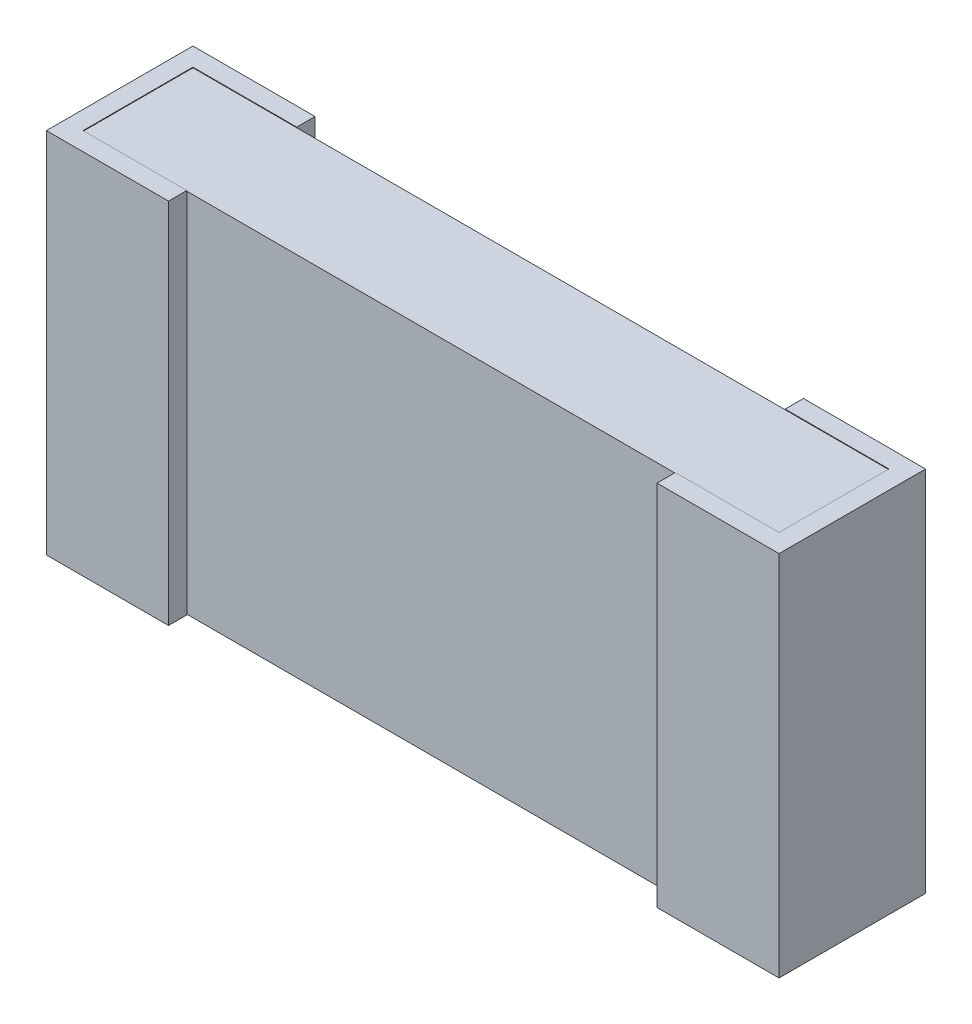
ISO-10303-21;
HEADER;
FILE_DESCRIPTION(('STEP AP214'),'2;1');
FILE_NAME('part.step','',(''),(''),'','','');
FILE_SCHEMA(('AUTOMOTIVE_DESIGN { 1 0 10303 214 1 1 1 1 }'));
ENDSEC;
DATA;
#1=APPLICATION_CONTEXT('core data for automotive mechanical design processes');
#2=APPLICATION_PROTOCOL_DEFINITION('international standard','automotive_design',2000,#1);
#3=PRODUCT_CONTEXT('',#1,'mechanical');
#4=PRODUCT('Part','Part','',(#3));
#5=PRODUCT_RELATED_PRODUCT_CATEGORY('part','',(#4));
#6=PRODUCT_DEFINITION_FORMATION('','',#4);
#7=PRODUCT_DEFINITION_CONTEXT('part definition',#1,'design');
#8=PRODUCT_DEFINITION('design','',#6,#7);
#9=PRODUCT_DEFINITION_SHAPE('','',#8);
#10=(LENGTH_UNIT() NAMED_UNIT(*) SI_UNIT(.MILLI.,.METRE.));
#11=(NAMED_UNIT(*) PLANE_ANGLE_UNIT() SI_UNIT($,.RADIAN.));
#12=(NAMED_UNIT(*) SI_UNIT($,.STERADIAN.) SOLID_ANGLE_UNIT());
#13=UNCERTAINTY_MEASURE_WITH_UNIT(LENGTH_MEASURE(1.E-05),#10,'distance_accuracy_value','');
#14=(GEOMETRIC_REPRESENTATION_CONTEXT(3) GLOBAL_UNCERTAINTY_ASSIGNED_CONTEXT((#13)) GLOBAL_UNIT_ASSIGNED_CONTEXT((#10,
#11,#12)) REPRESENTATION_CONTEXT('',''));
#15=CARTESIAN_POINT('',(0.,0.,0.));
#16=DIRECTION('',(0.,0.,1.));
#17=DIRECTION('',(1.,0.,0.));
#18=AXIS2_PLACEMENT_3D('',#15,#16,#17);
#19=CARTESIAN_POINT('',(0.0762,0.762,0.533400000000122));
#20=DIRECTION('',(0.,0.,-1.));
#21=DIRECTION('',(-1.,0.,0.));
#22=AXIS2_PLACEMENT_3D('',#19,#20,#21);
#23=PLANE('',#22);
#24=DIRECTION('',(0.,1.,0.));
#25=VECTOR('',#24,1.);
#26=CARTESIAN_POINT('',(2.54000000000002,-0.76454,0.533400000000122));
#27=LINE('',#26,#25);
#28=CARTESIAN_POINT('',(2.54000000000001,-0.762,0.533400000000122));
#29=VERTEX_POINT('',#28);
#30=CARTESIAN_POINT('',(2.54000000000001,0.762,0.533400000000122));
#31=VERTEX_POINT('',#30);
#32=EDGE_CURVE('E55',#29,#31,#27,.T.);
#33=ORIENTED_EDGE('',*,*,#32,.T.);
#34=DIRECTION('',(1.,0.,0.));
#35=VECTOR('',#34,1.);
#36=CARTESIAN_POINT('',(0.0762,0.762,0.533400000000122));
#37=LINE('',#36,#35);
#38=CARTESIAN_POINT('',(0.507999999999976,0.762,0.533400000000122));
#39=VERTEX_POINT('',#38);
#40=EDGE_CURVE('E40',#39,#31,#37,.T.);
#41=ORIENTED_EDGE('',*,*,#40,.F.);
#42=DIRECTION('',(0.,1.,0.));
#43=VECTOR('',#42,1.);
#44=CARTESIAN_POINT('',(0.507999999999976,-0.76454,0.533400000000122));
#45=LINE('',#44,#43);
#46=CARTESIAN_POINT('',(0.507999999999976,-0.762,0.533400000000122));
#47=VERTEX_POINT('',#46);
#48=EDGE_CURVE('E351',#47,#39,#45,.T.);
#49=ORIENTED_EDGE('',*,*,#48,.F.);
#50=DIRECTION('',(1.,0.,0.));
#51=VECTOR('',#50,1.);
#52=CARTESIAN_POINT('',(0.0762,-0.762,0.533400000000122));
#53=LINE('',#52,#51);
#54=EDGE_CURVE('E368',#47,#29,#53,.T.);
#55=ORIENTED_EDGE('',*,*,#54,.T.);
#56=EDGE_LOOP('',(#33,#41,#49,#55));
#57=FACE_BOUND('',#56,.T.);
#58=ADVANCED_FACE('F32',(#57),#23,.F.);
#59=CARTESIAN_POINT('',(2.9718,0.762,0.0762000000001228));
#60=DIRECTION('',(0.,0.,1.));
#61=DIRECTION('',(1.,0.,0.));
#62=AXIS2_PLACEMENT_3D('',#59,#60,#61);
#63=PLANE('',#62);
#64=DIRECTION('',(0.,1.,0.));
#65=VECTOR('',#64,1.);
#66=CARTESIAN_POINT('',(2.54,-0.76454,0.0762000000001224));
#67=LINE('',#66,#65);
#68=CARTESIAN_POINT('',(2.54,-0.762,0.0762000000001224));
#69=VERTEX_POINT('',#68);
#70=CARTESIAN_POINT('',(2.54000000000001,0.762,0.0762000000001224));
#71=VERTEX_POINT('',#70);
#72=EDGE_CURVE('E275',#69,#71,#67,.T.);
#73=ORIENTED_EDGE('',*,*,#72,.F.);
#74=DIRECTION('',(-1.,0.,0.));
#75=VECTOR('',#74,1.);
#76=CARTESIAN_POINT('',(2.9718,-0.762,0.0762000000001228));
#77=LINE('',#76,#75);
#78=CARTESIAN_POINT('',(0.508,-0.762,0.0762000000001224));
#79=VERTEX_POINT('',#78);
#80=EDGE_CURVE('E362',#69,#79,#77,.T.);
#81=ORIENTED_EDGE('',*,*,#80,.T.);
#82=DIRECTION('',(0.,1.,0.));
#83=VECTOR('',#82,1.);
#84=CARTESIAN_POINT('',(0.508,-0.76454,0.0762000000001224));
#85=LINE('',#84,#83);
#86=CARTESIAN_POINT('',(0.508,0.762,0.0762000000001224));
#87=VERTEX_POINT('',#86);
#88=EDGE_CURVE('E338',#79,#87,#85,.T.);
#89=ORIENTED_EDGE('',*,*,#88,.T.);
#90=DIRECTION('',(-1.,0.,0.));
#91=VECTOR('',#90,1.);
#92=CARTESIAN_POINT('',(2.9718,0.762,0.0762000000001228));
#93=LINE('',#92,#91);
#94=EDGE_CURVE('E47',#71,#87,#93,.T.);
#95=ORIENTED_EDGE('',*,*,#94,.F.);
#96=EDGE_LOOP('',(#73,#81,#89,#95));
#97=FACE_BOUND('',#96,.T.);
#98=ADVANCED_FACE('F34',(#97),#63,.F.);
#99=CARTESIAN_POINT('',(0.0762000000000002,0.762,0.0762000000001225));
#100=DIRECTION('',(0.,1.,0.));
#101=DIRECTION('',(0.,0.,1.));
#102=AXIS2_PLACEMENT_3D('',#99,#100,#101);
#103=PLANE('',#102);
#104=DIRECTION('',(0.,0.,-1.));
#105=VECTOR('',#104,1.);
#106=CARTESIAN_POINT('',(0.0762,0.762,0.533400000000122));
#107=LINE('',#106,#105);
#108=CARTESIAN_POINT('',(0.0762,0.762,0.533400000000122));
#109=VERTEX_POINT('',#108);
#110=CARTESIAN_POINT('',(0.0762000000000002,0.762,0.0762000000001224));
#111=VERTEX_POINT('',#110);
#112=EDGE_CURVE('E367',#109,#111,#107,.T.);
#113=ORIENTED_EDGE('',*,*,#112,.F.);
#114=EDGE_CURVE('E11',#109,#39,#37,.T.);
#115=ORIENTED_EDGE('',*,*,#114,.T.);
#116=ORIENTED_EDGE('',*,*,#40,.T.);
#117=DIRECTION('',(-1.,0.,0.));
#118=VECTOR('',#117,1.);
#119=CARTESIAN_POINT('',(0.0762000000000002,0.762,0.533400000000122));
#120=LINE('',#119,#118);
#121=CARTESIAN_POINT('',(2.9718,0.762,0.533400000000122));
#122=VERTEX_POINT('',#121);
#123=EDGE_CURVE('E279',#122,#31,#120,.T.);
#124=ORIENTED_EDGE('',*,*,#123,.F.);
#125=DIRECTION('',(0.,0.,1.));
#126=VECTOR('',#125,1.);
#127=CARTESIAN_POINT('',(2.9718,0.762,0.0762000000001228));
#128=LINE('',#127,#126);
#129=CARTESIAN_POINT('',(2.9718,0.762,0.0762000000001228));
#130=VERTEX_POINT('',#129);
#131=EDGE_CURVE('E204',#130,#122,#128,.T.);
#132=ORIENTED_EDGE('',*,*,#131,.F.);
#133=EDGE_CURVE('E370',#130,#71,#93,.T.);
#134=ORIENTED_EDGE('',*,*,#133,.T.);
#135=ORIENTED_EDGE('',*,*,#94,.T.);
#136=DIRECTION('',(-1.,0.,0.));
#137=VECTOR('',#136,1.);
#138=CARTESIAN_POINT('',(0.0762000000000002,0.762,0.0762000000001224));
#139=LINE('',#138,#137);
#140=EDGE_CURVE('E350',#87,#111,#139,.T.);
#141=ORIENTED_EDGE('',*,*,#140,.T.);
#142=EDGE_LOOP('',(#113,#115,#116,#124,#132,#134,#135,#141));
#143=FACE_BOUND('',#142,.T.);
#144=ADVANCED_FACE('F373',(#143),#103,.T.);
#145=CARTESIAN_POINT('',(0.0762000000000002,-0.762,0.0762000000001225));
#146=DIRECTION('',(0.,1.,0.));
#147=DIRECTION('',(0.,0.,1.));
#148=AXIS2_PLACEMENT_3D('',#145,#146,#147);
#149=PLANE('',#148);
#150=DIRECTION('',(0.,0.,-1.));
#151=VECTOR('',#150,1.);
#152=CARTESIAN_POINT('',(0.0762,-0.762,0.533400000000122));
#153=LINE('',#152,#151);
#154=CARTESIAN_POINT('',(0.0762,-0.762,0.533400000000122));
#155=VERTEX_POINT('',#154);
#156=CARTESIAN_POINT('',(0.0762000000000002,-0.762,0.0762000000001225));
#157=VERTEX_POINT('',#156);
#158=EDGE_CURVE('E354',#155,#157,#153,.T.);
#159=ORIENTED_EDGE('',*,*,#158,.T.);
#160=EDGE_CURVE('E357',#79,#157,#77,.T.);
#161=ORIENTED_EDGE('',*,*,#160,.F.);
#162=ORIENTED_EDGE('',*,*,#80,.F.);
#163=CARTESIAN_POINT('',(2.9718,-0.762,0.0762000000001228));
#164=VERTEX_POINT('',#163);
#165=EDGE_CURVE('E358',#164,#69,#77,.T.);
#166=ORIENTED_EDGE('',*,*,#165,.F.);
#167=DIRECTION('',(0.,0.,1.));
#168=VECTOR('',#167,1.);
#169=CARTESIAN_POINT('',(2.9718,-0.762,0.0762000000001228));
#170=LINE('',#169,#168);
#171=CARTESIAN_POINT('',(2.9718,-0.762,0.533400000000122));
#172=VERTEX_POINT('',#171);
#173=EDGE_CURVE('E361',#164,#172,#170,.T.);
#174=ORIENTED_EDGE('',*,*,#173,.T.);
#175=EDGE_CURVE('E364',#29,#172,#53,.T.);
#176=ORIENTED_EDGE('',*,*,#175,.F.);
#177=ORIENTED_EDGE('',*,*,#54,.F.);
#178=EDGE_CURVE('E365',#155,#47,#53,.T.);
#179=ORIENTED_EDGE('',*,*,#178,.F.);
#180=EDGE_LOOP('',(#159,#161,#162,#166,#174,#176,#177,#179));
#181=FACE_BOUND('',#180,.T.);
#182=ADVANCED_FACE('F420',(#181),#149,.F.);
#183=CARTESIAN_POINT('',(0.0762,-0.76454,0.533400000000122));
#184=DIRECTION('',(0.,0.,1.));
#185=DIRECTION('',(1.,0.,0.));
#186=AXIS2_PLACEMENT_3D('',#183,#184,#185);
#187=PLANE('',#186);
#188=DIRECTION('',(0.,1.,0.));
#189=VECTOR('',#188,1.);
#190=CARTESIAN_POINT('',(0.0762,-0.76454,0.533400000000122));
#191=LINE('',#190,#189);
#192=CARTESIAN_POINT('',(0.0762,-0.76454,0.533400000000122));
#193=VERTEX_POINT('',#192);
#194=EDGE_CURVE('E327',#193,#155,#191,.T.);
#195=ORIENTED_EDGE('',*,*,#194,.T.);
#196=ORIENTED_EDGE('',*,*,#178,.T.);
#197=CARTESIAN_POINT('',(0.507999999999976,-0.76454,0.533400000000122));
#198=VERTEX_POINT('',#197);
#199=EDGE_CURVE('E347',#198,#47,#45,.T.);
#200=ORIENTED_EDGE('',*,*,#199,.F.);
#201=DIRECTION('',(1.,0.,0.));
#202=VECTOR('',#201,1.);
#203=CARTESIAN_POINT('',(0.0762,-0.76454,0.533400000000122));
#204=LINE('',#203,#202);
#205=EDGE_CURVE('E305',#193,#198,#204,.T.);
#206=ORIENTED_EDGE('',*,*,#205,.F.);
#207=EDGE_LOOP('',(#195,#196,#200,#206));
#208=FACE_BOUND('',#207,.T.);
#209=ADVANCED_FACE('F427',(#208),#187,.F.);
#210=CARTESIAN_POINT('',(0.508,-0.76454,0.0762000000001224));
#211=DIRECTION('',(0.,0.,-1.));
#212=DIRECTION('',(-1.,0.,0.));
#213=AXIS2_PLACEMENT_3D('',#210,#211,#212);
#214=PLANE('',#213);
#215=CARTESIAN_POINT('',(0.508,-0.76454,0.0762000000001224));
#216=VERTEX_POINT('',#215);
#217=EDGE_CURVE('E334',#216,#79,#85,.T.);
#218=ORIENTED_EDGE('',*,*,#217,.T.);
#219=ORIENTED_EDGE('',*,*,#160,.T.);
#220=DIRECTION('',(0.,1.,0.));
#221=VECTOR('',#220,1.);
#222=CARTESIAN_POINT('',(0.0762000000000002,-0.76454,0.0762000000001224));
#223=LINE('',#222,#221);
#224=CARTESIAN_POINT('',(0.0762000000000002,-0.76454,0.0762000000001224));
#225=VERTEX_POINT('',#224);
#226=EDGE_CURVE('E331',#225,#157,#223,.T.);
#227=ORIENTED_EDGE('',*,*,#226,.F.);
#228=DIRECTION('',(-1.,0.,0.));
#229=VECTOR('',#228,1.);
#230=CARTESIAN_POINT('',(0.508,-0.76454,0.0762000000001224));
#231=LINE('',#230,#229);
#232=EDGE_CURVE('E322',#216,#225,#231,.T.);
#233=ORIENTED_EDGE('',*,*,#232,.F.);
#234=EDGE_LOOP('',(#218,#219,#227,#233));
#235=FACE_BOUND('',#234,.T.);
#236=ADVANCED_FACE('F416',(#235),#214,.F.);
#237=CARTESIAN_POINT('',(0.0762000000000002,-0.76454,0.0762000000001224));
#238=DIRECTION('',(-1.,0.,0.));
#239=DIRECTION('',(0.,0.,1.));
#240=AXIS2_PLACEMENT_3D('',#237,#238,#239);
#241=PLANE('',#240);
#242=ORIENTED_EDGE('',*,*,#226,.T.);
#243=ORIENTED_EDGE('',*,*,#158,.F.);
#244=ORIENTED_EDGE('',*,*,#194,.F.);
#245=DIRECTION('',(0.,0.,1.));
#246=VECTOR('',#245,1.);
#247=CARTESIAN_POINT('',(0.0762000000000002,-0.76454,0.0762000000001224));
#248=LINE('',#247,#246);
#249=EDGE_CURVE('E324',#225,#193,#248,.T.);
#250=ORIENTED_EDGE('',*,*,#249,.F.);
#251=EDGE_LOOP('',(#242,#243,#244,#250));
#252=FACE_BOUND('',#251,.T.);
#253=ADVANCED_FACE('F424',(#252),#241,.F.);
#254=ORIENTED_EDGE('',*,*,#114,.F.);
#255=CARTESIAN_POINT('',(0.0762,0.76454,0.533400000000122));
#256=VERTEX_POINT('',#255);
#257=EDGE_CURVE('E326',#109,#256,#191,.T.);
#258=ORIENTED_EDGE('',*,*,#257,.T.);
#259=DIRECTION('',(1.,0.,0.));
#260=VECTOR('',#259,1.);
#261=CARTESIAN_POINT('',(0.0762,0.76454,0.533400000000122));
#262=LINE('',#261,#260);
#263=CARTESIAN_POINT('',(0.507999999999976,0.76454,0.533400000000122));
#264=VERTEX_POINT('',#263);
#265=EDGE_CURVE('E281',#256,#264,#262,.T.);
#266=ORIENTED_EDGE('',*,*,#265,.T.);
#267=EDGE_CURVE('E346',#39,#264,#45,.T.);
#268=ORIENTED_EDGE('',*,*,#267,.F.);
#269=EDGE_LOOP('',(#254,#258,#266,#268));
#270=FACE_BOUND('',#269,.T.);
#271=ADVANCED_FACE('F448',(#270),#187,.F.);
#272=CARTESIAN_POINT('',(0.508,-0.76454,0.609599999999878));
#273=DIRECTION('',(1.,0.,-3.08755736784921E-13));
#274=DIRECTION('',(-3.08755736784921E-13,0.,-1.));
#275=AXIS2_PLACEMENT_3D('',#272,#273,#274);
#276=PLANE('',#275);
#277=DIRECTION('',(-3.08755736784921E-13,0.,-1.));
#278=VECTOR('',#277,1.);
#279=CARTESIAN_POINT('',(0.508,0.76454,0.609599999999878));
#280=LINE('',#279,#278);
#281=CARTESIAN_POINT('',(0.508,0.76454,0.609599999999878));
#282=VERTEX_POINT('',#281);
#283=EDGE_CURVE('E284',#282,#264,#280,.T.);
#284=ORIENTED_EDGE('',*,*,#283,.F.);
#285=DIRECTION('',(0.,1.,0.));
#286=VECTOR('',#285,1.);
#287=CARTESIAN_POINT('',(0.508,-0.76454,0.609599999999878));
#288=LINE('',#287,#286);
#289=CARTESIAN_POINT('',(0.508,-0.76454,0.609599999999878));
#290=VERTEX_POINT('',#289);
#291=EDGE_CURVE('E344',#290,#282,#288,.T.);
#292=ORIENTED_EDGE('',*,*,#291,.F.);
#293=DIRECTION('',(-3.08755736784921E-13,0.,-1.));
#294=VECTOR('',#293,1.);
#295=CARTESIAN_POINT('',(0.508,-0.76454,0.609599999999878));
#296=LINE('',#295,#294);
#297=EDGE_CURVE('E307',#290,#198,#296,.T.);
#298=ORIENTED_EDGE('',*,*,#297,.T.);
#299=ORIENTED_EDGE('',*,*,#199,.T.);
#300=ORIENTED_EDGE('',*,*,#48,.T.);
#301=ORIENTED_EDGE('',*,*,#267,.T.);
#302=EDGE_LOOP('',(#284,#292,#298,#299,#300,#301));
#303=FACE_BOUND('',#302,.T.);
#304=ADVANCED_FACE('F452',(#303),#276,.T.);
#305=CARTESIAN_POINT('',(0.,-0.76454,0.609599999999878));
#306=DIRECTION('',(0.,0.,1.));
#307=DIRECTION('',(1.,0.,0.));
#308=AXIS2_PLACEMENT_3D('',#305,#306,#307);
#309=PLANE('',#308);
#310=DIRECTION('',(1.,0.,0.));
#311=VECTOR('',#310,1.);
#312=CARTESIAN_POINT('',(0.,0.76454,0.609599999999878));
#313=LINE('',#312,#311);
#314=CARTESIAN_POINT('',(0.,0.76454,0.609599999999878));
#315=VERTEX_POINT('',#314);
#316=EDGE_CURVE('E287',#315,#282,#313,.T.);
#317=ORIENTED_EDGE('',*,*,#316,.F.);
#318=DIRECTION('',(0.,1.,0.));
#319=VECTOR('',#318,1.);
#320=CARTESIAN_POINT('',(0.,-0.76454,0.609599999999878));
#321=LINE('',#320,#319);
#322=CARTESIAN_POINT('',(0.,-0.76454,0.609599999999878));
#323=VERTEX_POINT('',#322);
#324=EDGE_CURVE('E342',#323,#315,#321,.T.);
#325=ORIENTED_EDGE('',*,*,#324,.F.);
#326=DIRECTION('',(1.,0.,0.));
#327=VECTOR('',#326,1.);
#328=CARTESIAN_POINT('',(0.,-0.76454,0.609599999999878));
#329=LINE('',#328,#327);
#330=EDGE_CURVE('E310',#323,#290,#329,.T.);
#331=ORIENTED_EDGE('',*,*,#330,.T.);
#332=ORIENTED_EDGE('',*,*,#291,.T.);
#333=EDGE_LOOP('',(#317,#325,#331,#332));
#334=FACE_BOUND('',#333,.T.);
#335=ADVANCED_FACE('F489',(#334),#309,.T.);
#336=CARTESIAN_POINT('',(0.,-0.76454,0.));
#337=DIRECTION('',(-1.,0.,0.));
#338=DIRECTION('',(0.,0.,1.));
#339=AXIS2_PLACEMENT_3D('',#336,#337,#338);
#340=PLANE('',#339);
#341=DIRECTION('',(0.,0.,1.));
#342=VECTOR('',#341,1.);
#343=CARTESIAN_POINT('',(0.,0.76454,0.));
#344=LINE('',#343,#342);
#345=CARTESIAN_POINT('',(0.,0.76454,0.));
#346=VERTEX_POINT('',#345);
#347=EDGE_CURVE('E290',#346,#315,#344,.T.);
#348=ORIENTED_EDGE('',*,*,#347,.F.);
#349=DIRECTION('',(0.,1.,0.));
#350=VECTOR('',#349,1.);
#351=CARTESIAN_POINT('',(0.,-0.76454,0.));
#352=LINE('',#351,#350);
#353=CARTESIAN_POINT('',(0.,-0.76454,0.));
#354=VERTEX_POINT('',#353);
#355=EDGE_CURVE('E340',#354,#346,#352,.T.);
#356=ORIENTED_EDGE('',*,*,#355,.F.);
#357=DIRECTION('',(0.,0.,1.));
#358=VECTOR('',#357,1.);
#359=CARTESIAN_POINT('',(0.,-0.76454,0.));
#360=LINE('',#359,#358);
#361=EDGE_CURVE('E313',#354,#323,#360,.T.);
#362=ORIENTED_EDGE('',*,*,#361,.T.);
#363=ORIENTED_EDGE('',*,*,#324,.T.);
#364=EDGE_LOOP('',(#348,#356,#362,#363));
#365=FACE_BOUND('',#364,.T.);
#366=ADVANCED_FACE('F492',(#365),#340,.T.);
#367=CARTESIAN_POINT('',(0.507999999999976,-0.76454,0.));
#368=DIRECTION('',(0.,0.,-1.));
#369=DIRECTION('',(-1.,0.,0.));
#370=AXIS2_PLACEMENT_3D('',#367,#368,#369);
#371=PLANE('',#370);
#372=DIRECTION('',(-1.,0.,0.));
#373=VECTOR('',#372,1.);
#374=CARTESIAN_POINT('',(0.507999999999976,0.76454,0.));
#375=LINE('',#374,#373);
#376=CARTESIAN_POINT('',(0.507999999999976,0.76454,0.));
#377=VERTEX_POINT('',#376);
#378=EDGE_CURVE('E293',#377,#346,#375,.T.);
#379=ORIENTED_EDGE('',*,*,#378,.F.);
#380=DIRECTION('',(0.,1.,0.));
#381=VECTOR('',#380,1.);
#382=CARTESIAN_POINT('',(0.507999999999976,-0.76454,0.));
#383=LINE('',#382,#381);
#384=CARTESIAN_POINT('',(0.507999999999976,-0.76454,0.));
#385=VERTEX_POINT('',#384);
#386=EDGE_CURVE('E337',#385,#377,#383,.T.);
#387=ORIENTED_EDGE('',*,*,#386,.F.);
#388=DIRECTION('',(-1.,0.,0.));
#389=VECTOR('',#388,1.);
#390=CARTESIAN_POINT('',(0.507999999999976,-0.76454,0.));
#391=LINE('',#390,#389);
#392=EDGE_CURVE('E316',#385,#354,#391,.T.);
#393=ORIENTED_EDGE('',*,*,#392,.T.);
#394=ORIENTED_EDGE('',*,*,#355,.T.);
#395=EDGE_LOOP('',(#379,#387,#393,#394));
#396=FACE_BOUND('',#395,.T.);
#397=ADVANCED_FACE('F438',(#396),#371,.T.);
#398=CARTESIAN_POINT('',(0.508,-0.76454,0.0762000000001224));
#399=DIRECTION('',(1.,0.,-3.10178574280132E-13));
#400=DIRECTION('',(-3.10178574280132E-13,0.,-1.));
#401=AXIS2_PLACEMENT_3D('',#398,#399,#400);
#402=PLANE('',#401);
#403=DIRECTION('',(-3.10178574280132E-13,0.,-1.));
#404=VECTOR('',#403,1.);
#405=CARTESIAN_POINT('',(0.508,0.76454,0.0762000000001224));
#406=LINE('',#405,#404);
#407=CARTESIAN_POINT('',(0.508,0.76454,0.0762000000001224));
#408=VERTEX_POINT('',#407);
#409=EDGE_CURVE('E296',#408,#377,#406,.T.);
#410=ORIENTED_EDGE('',*,*,#409,.F.);
#411=EDGE_CURVE('E333',#87,#408,#85,.T.);
#412=ORIENTED_EDGE('',*,*,#411,.F.);
#413=ORIENTED_EDGE('',*,*,#88,.F.);
#414=ORIENTED_EDGE('',*,*,#217,.F.);
#415=DIRECTION('',(-3.10178574280132E-13,0.,-1.));
#416=VECTOR('',#415,1.);
#417=CARTESIAN_POINT('',(0.508,-0.76454,0.0762000000001224));
#418=LINE('',#417,#416);
#419=EDGE_CURVE('E319',#216,#385,#418,.T.);
#420=ORIENTED_EDGE('',*,*,#419,.T.);
#421=ORIENTED_EDGE('',*,*,#386,.T.);
#422=EDGE_LOOP('',(#410,#412,#413,#414,#420,#421));
#423=FACE_BOUND('',#422,.T.);
#424=ADVANCED_FACE('F410',(#423),#402,.T.);
#425=ORIENTED_EDGE('',*,*,#140,.F.);
#426=ORIENTED_EDGE('',*,*,#411,.T.);
#427=DIRECTION('',(-1.,0.,0.));
#428=VECTOR('',#427,1.);
#429=CARTESIAN_POINT('',(0.508,0.76454,0.0762000000001224));
#430=LINE('',#429,#428);
#431=CARTESIAN_POINT('',(0.0762000000000002,0.76454,0.0762000000001224));
#432=VERTEX_POINT('',#431);
#433=EDGE_CURVE('E299',#408,#432,#430,.T.);
#434=ORIENTED_EDGE('',*,*,#433,.T.);
#435=EDGE_CURVE('E330',#111,#432,#223,.T.);
#436=ORIENTED_EDGE('',*,*,#435,.F.);
#437=EDGE_LOOP('',(#425,#426,#434,#436));
#438=FACE_BOUND('',#437,.T.);
#439=ADVANCED_FACE('F405',(#438),#214,.F.);
#440=ORIENTED_EDGE('',*,*,#112,.T.);
#441=ORIENTED_EDGE('',*,*,#435,.T.);
#442=DIRECTION('',(0.,0.,1.));
#443=VECTOR('',#442,1.);
#444=CARTESIAN_POINT('',(0.0762000000000002,0.76454,0.0762000000001224));
#445=LINE('',#444,#443);
#446=EDGE_CURVE('E302',#432,#256,#445,.T.);
#447=ORIENTED_EDGE('',*,*,#446,.T.);
#448=ORIENTED_EDGE('',*,*,#257,.F.);
#449=EDGE_LOOP('',(#440,#441,#447,#448));
#450=FACE_BOUND('',#449,.T.);
#451=ADVANCED_FACE('F446',(#450),#241,.F.);
#452=CARTESIAN_POINT('',(0.,-0.76454,0.533400000000122));
#453=DIRECTION('',(0.,-1.,0.));
#454=DIRECTION('',(0.,0.,-1.));
#455=AXIS2_PLACEMENT_3D('',#452,#453,#454);
#456=PLANE('',#455);
#457=ORIENTED_EDGE('',*,*,#205,.T.);
#458=ORIENTED_EDGE('',*,*,#297,.F.);
#459=ORIENTED_EDGE('',*,*,#330,.F.);
#460=ORIENTED_EDGE('',*,*,#361,.F.);
#461=ORIENTED_EDGE('',*,*,#392,.F.);
#462=ORIENTED_EDGE('',*,*,#419,.F.);
#463=ORIENTED_EDGE('',*,*,#232,.T.);
#464=ORIENTED_EDGE('',*,*,#249,.T.);
#465=EDGE_LOOP('',(#457,#458,#459,#460,#461,#462,#463,#464));
#466=FACE_BOUND('',#465,.T.);
#467=ADVANCED_FACE('F431',(#466),#456,.T.);
#468=CARTESIAN_POINT('',(0.,0.76454,0.533400000000122));
#469=DIRECTION('',(0.,-1.,0.));
#470=DIRECTION('',(0.,0.,-1.));
#471=AXIS2_PLACEMENT_3D('',#468,#469,#470);
#472=PLANE('',#471);
#473=ORIENTED_EDGE('',*,*,#265,.F.);
#474=ORIENTED_EDGE('',*,*,#446,.F.);
#475=ORIENTED_EDGE('',*,*,#433,.F.);
#476=ORIENTED_EDGE('',*,*,#409,.T.);
#477=ORIENTED_EDGE('',*,*,#378,.T.);
#478=ORIENTED_EDGE('',*,*,#347,.T.);
#479=ORIENTED_EDGE('',*,*,#316,.T.);
#480=ORIENTED_EDGE('',*,*,#283,.T.);
#481=EDGE_LOOP('',(#473,#474,#475,#476,#477,#478,#479,#480));
#482=FACE_BOUND('',#481,.T.);
#483=ADVANCED_FACE('F442',(#482),#472,.F.);
#484=CARTESIAN_POINT('',(2.9718,-0.76454,0.533400000000122));
#485=DIRECTION('',(0.,0.,-1.));
#486=DIRECTION('',(-1.,0.,0.));
#487=AXIS2_PLACEMENT_3D('',#484,#485,#486);
#488=PLANE('',#487);
#489=ORIENTED_EDGE('',*,*,#175,.T.);
#490=DIRECTION('',(0.,1.,0.));
#491=VECTOR('',#490,1.);
#492=CARTESIAN_POINT('',(2.9718,-0.76454,0.533400000000122));
#493=LINE('',#492,#491);
#494=CARTESIAN_POINT('',(2.9718,-0.76454,0.533400000000122));
#495=VERTEX_POINT('',#494);
#496=EDGE_CURVE('E207',#495,#172,#493,.T.);
#497=ORIENTED_EDGE('',*,*,#496,.F.);
#498=DIRECTION('',(-1.,0.,0.));
#499=VECTOR('',#498,1.);
#500=CARTESIAN_POINT('',(2.9718,-0.76454,0.533400000000122));
#501=LINE('',#500,#499);
#502=CARTESIAN_POINT('',(2.54000000000002,-0.76454,0.533400000000122));
#503=VERTEX_POINT('',#502);
#504=EDGE_CURVE('E236',#495,#503,#501,.T.);
#505=ORIENTED_EDGE('',*,*,#504,.T.);
#506=EDGE_CURVE('E255',#503,#29,#27,.T.);
#507=ORIENTED_EDGE('',*,*,#506,.T.);
#508=EDGE_LOOP('',(#489,#497,#505,#507));
#509=FACE_BOUND('',#508,.T.);
#510=ADVANCED_FACE('F455',(#509),#488,.T.);
#511=CARTESIAN_POINT('',(2.9718,-0.76454,0.0762000000001224));
#512=DIRECTION('',(-1.,0.,0.));
#513=DIRECTION('',(0.,0.,1.));
#514=AXIS2_PLACEMENT_3D('',#511,#512,#513);
#515=PLANE('',#514);
#516=ORIENTED_EDGE('',*,*,#173,.F.);
#517=DIRECTION('',(0.,1.,0.));
#518=VECTOR('',#517,1.);
#519=CARTESIAN_POINT('',(2.9718,-0.76454,0.0762000000001224));
#520=LINE('',#519,#518);
#521=CARTESIAN_POINT('',(2.9718,-0.76454,0.0762000000001224));
#522=VERTEX_POINT('',#521);
#523=EDGE_CURVE('E208',#522,#164,#520,.T.);
#524=ORIENTED_EDGE('',*,*,#523,.F.);
#525=DIRECTION('',(0.,0.,1.));
#526=VECTOR('',#525,1.);
#527=CARTESIAN_POINT('',(2.9718,-0.76454,0.0762000000001224));
#528=LINE('',#527,#526);
#529=EDGE_CURVE('E239',#522,#495,#528,.T.);
#530=ORIENTED_EDGE('',*,*,#529,.T.);
#531=ORIENTED_EDGE('',*,*,#496,.T.);
#532=EDGE_LOOP('',(#516,#524,#530,#531));
#533=FACE_BOUND('',#532,.T.);
#534=ADVANCED_FACE('F459',(#533),#515,.T.);
#535=CARTESIAN_POINT('',(2.54,-0.76454,0.0762000000001224));
#536=DIRECTION('',(0.,0.,1.));
#537=DIRECTION('',(1.,0.,0.));
#538=AXIS2_PLACEMENT_3D('',#535,#536,#537);
#539=PLANE('',#538);
#540=ORIENTED_EDGE('',*,*,#165,.T.);
#541=CARTESIAN_POINT('',(2.54,-0.76454,0.0762000000001224));
#542=VERTEX_POINT('',#541);
#543=EDGE_CURVE('E271',#542,#69,#67,.T.);
#544=ORIENTED_EDGE('',*,*,#543,.F.);
#545=DIRECTION('',(1.,0.,0.));
#546=VECTOR('',#545,1.);
#547=CARTESIAN_POINT('',(2.54,-0.76454,0.0762000000001224));
#548=LINE('',#547,#546);
#549=EDGE_CURVE('E242',#542,#522,#548,.T.);
#550=ORIENTED_EDGE('',*,*,#549,.T.);
#551=ORIENTED_EDGE('',*,*,#523,.T.);
#552=EDGE_LOOP('',(#540,#544,#550,#551));
#553=FACE_BOUND('',#552,.T.);
#554=ADVANCED_FACE('F465',(#553),#539,.T.);
#555=CARTESIAN_POINT('',(2.9718,0.76454,0.533400000000122));
#556=VERTEX_POINT('',#555);
#557=EDGE_CURVE('E197',#122,#556,#493,.T.);
#558=ORIENTED_EDGE('',*,*,#557,.F.);
#559=ORIENTED_EDGE('',*,*,#123,.T.);
#560=CARTESIAN_POINT('',(2.54000000000002,0.76454,0.533400000000122));
#561=VERTEX_POINT('',#560);
#562=EDGE_CURVE('E214',#31,#561,#27,.T.);
#563=ORIENTED_EDGE('',*,*,#562,.T.);
#564=DIRECTION('',(-1.,0.,0.));
#565=VECTOR('',#564,1.);
#566=CARTESIAN_POINT('',(2.9718,0.76454,0.533400000000122));
#567=LINE('',#566,#565);
#568=EDGE_CURVE('E211',#556,#561,#567,.T.);
#569=ORIENTED_EDGE('',*,*,#568,.F.);
#570=EDGE_LOOP('',(#558,#559,#563,#569));
#571=FACE_BOUND('',#570,.T.);
#572=ADVANCED_FACE('F212',(#571),#488,.T.);
#573=CARTESIAN_POINT('',(2.9718,0.76454,0.0762000000001224));
#574=VERTEX_POINT('',#573);
#575=EDGE_CURVE('E274',#130,#574,#520,.T.);
#576=ORIENTED_EDGE('',*,*,#575,.F.);
#577=ORIENTED_EDGE('',*,*,#131,.T.);
#578=ORIENTED_EDGE('',*,*,#557,.T.);
#579=DIRECTION('',(0.,0.,1.));
#580=VECTOR('',#579,1.);
#581=CARTESIAN_POINT('',(2.9718,0.76454,0.0762000000001224));
#582=LINE('',#581,#580);
#583=EDGE_CURVE('E202',#574,#556,#582,.T.);
#584=ORIENTED_EDGE('',*,*,#583,.F.);
#585=EDGE_LOOP('',(#576,#577,#578,#584));
#586=FACE_BOUND('',#585,.T.);
#587=ADVANCED_FACE('F200',(#586),#515,.T.);
#588=CARTESIAN_POINT('',(2.54,0.76454,0.0762000000001224));
#589=VERTEX_POINT('',#588);
#590=EDGE_CURVE('E270',#71,#589,#67,.T.);
#591=ORIENTED_EDGE('',*,*,#590,.F.);
#592=ORIENTED_EDGE('',*,*,#133,.F.);
#593=ORIENTED_EDGE('',*,*,#575,.T.);
#594=DIRECTION('',(1.,0.,0.));
#595=VECTOR('',#594,1.);
#596=CARTESIAN_POINT('',(2.54,0.76454,0.0762000000001224));
#597=LINE('',#596,#595);
#598=EDGE_CURVE('E222',#589,#574,#597,.T.);
#599=ORIENTED_EDGE('',*,*,#598,.F.);
#600=EDGE_LOOP('',(#591,#592,#593,#599));
#601=FACE_BOUND('',#600,.T.);
#602=ADVANCED_FACE('F398',(#601),#539,.T.);
#603=CARTESIAN_POINT('',(2.54,-0.76454,0.0762000000001224));
#604=DIRECTION('',(1.,0.,3.10178574280132E-13));
#605=DIRECTION('',(3.10178574280132E-13,0.,-1.));
#606=AXIS2_PLACEMENT_3D('',#603,#604,#605);
#607=PLANE('',#606);
#608=DIRECTION('',(3.10178574280132E-13,0.,-1.));
#609=VECTOR('',#608,1.);
#610=CARTESIAN_POINT('',(2.54,0.76454,0.0762000000001224));
#611=LINE('',#610,#609);
#612=CARTESIAN_POINT('',(2.54000000000002,0.76454,0.));
#613=VERTEX_POINT('',#612);
#614=EDGE_CURVE('E224',#589,#613,#611,.T.);
#615=ORIENTED_EDGE('',*,*,#614,.T.);
#616=DIRECTION('',(0.,1.,0.));
#617=VECTOR('',#616,1.);
#618=CARTESIAN_POINT('',(2.54000000000002,-0.76454,0.));
#619=LINE('',#618,#617);
#620=CARTESIAN_POINT('',(2.54000000000002,-0.76454,0.));
#621=VERTEX_POINT('',#620);
#622=EDGE_CURVE('E267',#621,#613,#619,.T.);
#623=ORIENTED_EDGE('',*,*,#622,.F.);
#624=DIRECTION('',(3.10178574280132E-13,0.,-1.));
#625=VECTOR('',#624,1.);
#626=CARTESIAN_POINT('',(2.54,-0.76454,0.0762000000001224));
#627=LINE('',#626,#625);
#628=EDGE_CURVE('E245',#542,#621,#627,.T.);
#629=ORIENTED_EDGE('',*,*,#628,.F.);
#630=ORIENTED_EDGE('',*,*,#543,.T.);
#631=ORIENTED_EDGE('',*,*,#72,.T.);
#632=ORIENTED_EDGE('',*,*,#590,.T.);
#633=EDGE_LOOP('',(#615,#623,#629,#630,#631,#632));
#634=FACE_BOUND('',#633,.T.);
#635=ADVANCED_FACE('F467',(#634),#607,.F.);
#636=CARTESIAN_POINT('',(2.54000000000002,-0.76454,0.));
#637=DIRECTION('',(0.,0.,1.));
#638=DIRECTION('',(1.,0.,0.));
#639=AXIS2_PLACEMENT_3D('',#636,#637,#638);
#640=PLANE('',#639);
#641=DIRECTION('',(1.,0.,0.));
#642=VECTOR('',#641,1.);
#643=CARTESIAN_POINT('',(2.54000000000002,0.76454,0.));
#644=LINE('',#643,#642);
#645=CARTESIAN_POINT('',(3.048,0.76454,0.));
#646=VERTEX_POINT('',#645);
#647=EDGE_CURVE('E228',#613,#646,#644,.T.);
#648=ORIENTED_EDGE('',*,*,#647,.T.);
#649=DIRECTION('',(0.,1.,0.));
#650=VECTOR('',#649,1.);
#651=CARTESIAN_POINT('',(3.048,-0.76454,0.));
#652=LINE('',#651,#650);
#653=CARTESIAN_POINT('',(3.048,-0.76454,0.));
#654=VERTEX_POINT('',#653);
#655=EDGE_CURVE('E264',#654,#646,#652,.T.);
#656=ORIENTED_EDGE('',*,*,#655,.F.);
#657=DIRECTION('',(1.,0.,0.));
#658=VECTOR('',#657,1.);
#659=CARTESIAN_POINT('',(2.54000000000002,-0.76454,0.));
#660=LINE('',#659,#658);
#661=EDGE_CURVE('E247',#621,#654,#660,.T.);
#662=ORIENTED_EDGE('',*,*,#661,.F.);
#663=ORIENTED_EDGE('',*,*,#622,.T.);
#664=EDGE_LOOP('',(#648,#656,#662,#663));
#665=FACE_BOUND('',#664,.T.);
#666=ADVANCED_FACE('F393',(#665),#640,.F.);
#667=CARTESIAN_POINT('',(3.048,-0.76454,0.));
#668=DIRECTION('',(-1.,0.,0.));
#669=DIRECTION('',(0.,0.,1.));
#670=AXIS2_PLACEMENT_3D('',#667,#668,#669);
#671=PLANE('',#670);
#672=DIRECTION('',(0.,0.,1.));
#673=VECTOR('',#672,1.);
#674=CARTESIAN_POINT('',(3.048,0.76454,0.));
#675=LINE('',#674,#673);
#676=CARTESIAN_POINT('',(3.048,0.76454,0.609599999999878));
#677=VERTEX_POINT('',#676);
#678=EDGE_CURVE('E230',#646,#677,#675,.T.);
#679=ORIENTED_EDGE('',*,*,#678,.T.);
#680=DIRECTION('',(0.,1.,0.));
#681=VECTOR('',#680,1.);
#682=CARTESIAN_POINT('',(3.048,-0.76454,0.609599999999878));
#683=LINE('',#682,#681);
#684=CARTESIAN_POINT('',(3.048,-0.76454,0.609599999999878));
#685=VERTEX_POINT('',#684);
#686=EDGE_CURVE('E261',#685,#677,#683,.T.);
#687=ORIENTED_EDGE('',*,*,#686,.F.);
#688=DIRECTION('',(0.,0.,1.));
#689=VECTOR('',#688,1.);
#690=CARTESIAN_POINT('',(3.048,-0.76454,0.));
#691=LINE('',#690,#689);
#692=EDGE_CURVE('E249',#654,#685,#691,.T.);
#693=ORIENTED_EDGE('',*,*,#692,.F.);
#694=ORIENTED_EDGE('',*,*,#655,.T.);
#695=EDGE_LOOP('',(#679,#687,#693,#694));
#696=FACE_BOUND('',#695,.T.);
#697=ADVANCED_FACE('F389',(#696),#671,.F.);
#698=CARTESIAN_POINT('',(3.048,-0.76454,0.609599999999878));
#699=DIRECTION('',(0.,0.,-1.));
#700=DIRECTION('',(-1.,0.,0.));
#701=AXIS2_PLACEMENT_3D('',#698,#699,#700);
#702=PLANE('',#701);
#703=DIRECTION('',(-1.,0.,0.));
#704=VECTOR('',#703,1.);
#705=CARTESIAN_POINT('',(3.048,0.76454,0.609599999999878));
#706=LINE('',#705,#704);
#707=CARTESIAN_POINT('',(2.54,0.76454,0.609599999999878));
#708=VERTEX_POINT('',#707);
#709=EDGE_CURVE('E232',#677,#708,#706,.T.);
#710=ORIENTED_EDGE('',*,*,#709,.T.);
#711=DIRECTION('',(0.,1.,0.));
#712=VECTOR('',#711,1.);
#713=CARTESIAN_POINT('',(2.54,-0.76454,0.609599999999878));
#714=LINE('',#713,#712);
#715=CARTESIAN_POINT('',(2.54,-0.76454,0.609599999999878));
#716=VERTEX_POINT('',#715);
#717=EDGE_CURVE('E258',#716,#708,#714,.T.);
#718=ORIENTED_EDGE('',*,*,#717,.F.);
#719=DIRECTION('',(-1.,0.,0.));
#720=VECTOR('',#719,1.);
#721=CARTESIAN_POINT('',(3.048,-0.76454,0.609599999999878));
#722=LINE('',#721,#720);
#723=EDGE_CURVE('E251',#685,#716,#722,.T.);
#724=ORIENTED_EDGE('',*,*,#723,.F.);
#725=ORIENTED_EDGE('',*,*,#686,.T.);
#726=EDGE_LOOP('',(#710,#718,#724,#725));
#727=FACE_BOUND('',#726,.T.);
#728=ADVANCED_FACE('F384',(#727),#702,.F.);
#729=CARTESIAN_POINT('',(2.54,-0.76454,0.609599999999878));
#730=DIRECTION('',(1.,0.,3.08755736784921E-13));
#731=DIRECTION('',(3.08755736784921E-13,0.,-1.));
#732=AXIS2_PLACEMENT_3D('',#729,#730,#731);
#733=PLANE('',#732);
#734=DIRECTION('',(3.08755736784921E-13,0.,-1.));
#735=VECTOR('',#734,1.);
#736=CARTESIAN_POINT('',(2.54,0.76454,0.609599999999878));
#737=LINE('',#736,#735);
#738=EDGE_CURVE('E234',#708,#561,#737,.T.);
#739=ORIENTED_EDGE('',*,*,#738,.T.);
#740=ORIENTED_EDGE('',*,*,#562,.F.);
#741=ORIENTED_EDGE('',*,*,#32,.F.);
#742=ORIENTED_EDGE('',*,*,#506,.F.);
#743=DIRECTION('',(3.08755736784921E-13,0.,-1.));
#744=VECTOR('',#743,1.);
#745=CARTESIAN_POINT('',(2.54,-0.76454,0.609599999999878));
#746=LINE('',#745,#744);
#747=EDGE_CURVE('E253',#716,#503,#746,.T.);
#748=ORIENTED_EDGE('',*,*,#747,.F.);
#749=ORIENTED_EDGE('',*,*,#717,.T.);
#750=EDGE_LOOP('',(#739,#740,#741,#742,#748,#749));
#751=FACE_BOUND('',#750,.T.);
#752=ADVANCED_FACE('F376',(#751),#733,.F.);
#753=CARTESIAN_POINT('',(3.048,-0.76454,0.533400000000122));
#754=DIRECTION('',(0.,-1.,0.));
#755=DIRECTION('',(0.,0.,-1.));
#756=AXIS2_PLACEMENT_3D('',#753,#754,#755);
#757=PLANE('',#756);
#758=ORIENTED_EDGE('',*,*,#504,.F.);
#759=ORIENTED_EDGE('',*,*,#529,.F.);
#760=ORIENTED_EDGE('',*,*,#549,.F.);
#761=ORIENTED_EDGE('',*,*,#628,.T.);
#762=ORIENTED_EDGE('',*,*,#661,.T.);
#763=ORIENTED_EDGE('',*,*,#692,.T.);
#764=ORIENTED_EDGE('',*,*,#723,.T.);
#765=ORIENTED_EDGE('',*,*,#747,.T.);
#766=EDGE_LOOP('',(#758,#759,#760,#761,#762,#763,#764,#765));
#767=FACE_BOUND('',#766,.T.);
#768=ADVANCED_FACE('F463',(#767),#757,.T.);
#769=CARTESIAN_POINT('',(3.048,0.76454,0.533400000000122));
#770=DIRECTION('',(0.,-1.,0.));
#771=DIRECTION('',(0.,0.,-1.));
#772=AXIS2_PLACEMENT_3D('',#769,#770,#771);
#773=PLANE('',#772);
#774=ORIENTED_EDGE('',*,*,#568,.T.);
#775=ORIENTED_EDGE('',*,*,#738,.F.);
#776=ORIENTED_EDGE('',*,*,#709,.F.);
#777=ORIENTED_EDGE('',*,*,#678,.F.);
#778=ORIENTED_EDGE('',*,*,#647,.F.);
#779=ORIENTED_EDGE('',*,*,#614,.F.);
#780=ORIENTED_EDGE('',*,*,#598,.T.);
#781=ORIENTED_EDGE('',*,*,#583,.T.);
#782=EDGE_LOOP('',(#774,#775,#776,#777,#778,#779,#780,#781));
#783=FACE_BOUND('',#782,.T.);
#784=ADVANCED_FACE('F219',(#783),#773,.F.);
#785=CLOSED_SHELL('',(#58,#98,#144,#182,#209,#236,#253,#271,#304,#335,#366,#397,#424,#439,#451,
#467,#483,#510,#534,#554,#572,#587,#602,#635,#666,#697,#728,#752,#768,#784));
#786=MANIFOLD_SOLID_BREP('B2',#785);
#787=ADVANCED_BREP_SHAPE_REPRESENTATION('',(#18,#786),#14);
#788=SHAPE_DEFINITION_REPRESENTATION(#9,#787);
ENDSEC;
END-ISO-10303-21;
